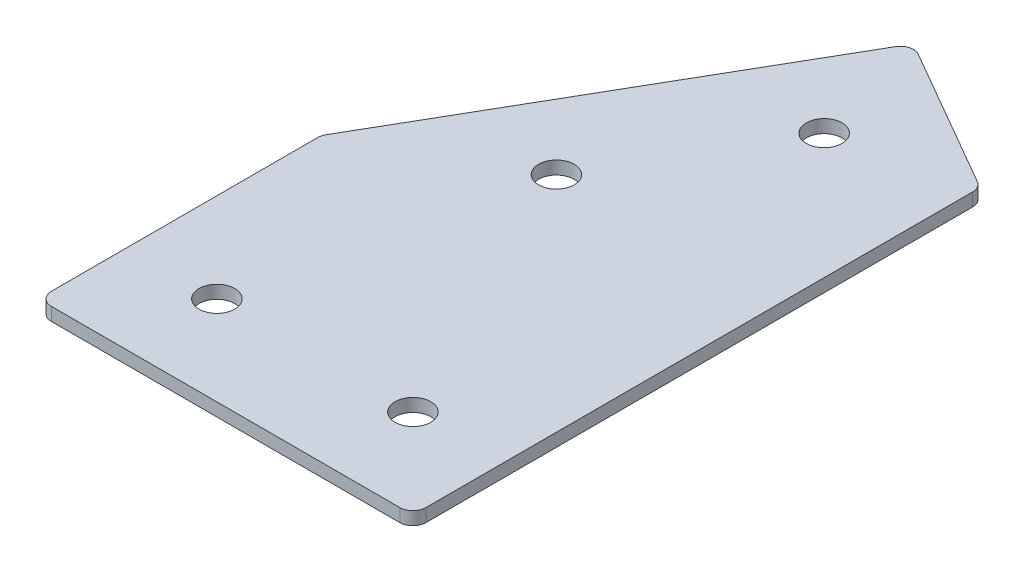
ISO-10303-21;
HEADER;
FILE_DESCRIPTION(('STEP AP214'),'2;1');
FILE_NAME('part.step','',(''),(''),'','','');
FILE_SCHEMA(('AUTOMOTIVE_DESIGN { 1 0 10303 214 1 1 1 1 }'));
ENDSEC;
DATA;
#1=APPLICATION_CONTEXT('core data for automotive mechanical design processes');
#2=APPLICATION_PROTOCOL_DEFINITION('international standard','automotive_design',2000,#1);
#3=PRODUCT_CONTEXT('',#1,'mechanical');
#4=PRODUCT('Part','Part','',(#3));
#5=PRODUCT_RELATED_PRODUCT_CATEGORY('part','',(#4));
#6=PRODUCT_DEFINITION_FORMATION('','',#4);
#7=PRODUCT_DEFINITION_CONTEXT('part definition',#1,'design');
#8=PRODUCT_DEFINITION('design','',#6,#7);
#9=PRODUCT_DEFINITION_SHAPE('','',#8);
#10=(LENGTH_UNIT() NAMED_UNIT(*) SI_UNIT(.MILLI.,.METRE.));
#11=(NAMED_UNIT(*) PLANE_ANGLE_UNIT() SI_UNIT($,.RADIAN.));
#12=(NAMED_UNIT(*) SI_UNIT($,.STERADIAN.) SOLID_ANGLE_UNIT());
#13=UNCERTAINTY_MEASURE_WITH_UNIT(LENGTH_MEASURE(1.E-05),#10,'distance_accuracy_value','');
#14=(GEOMETRIC_REPRESENTATION_CONTEXT(3) GLOBAL_UNCERTAINTY_ASSIGNED_CONTEXT((#13)) GLOBAL_UNIT_ASSIGNED_CONTEXT((#10,
#11,#12)) REPRESENTATION_CONTEXT('',''));
#15=CARTESIAN_POINT('',(0.,0.,0.));
#16=DIRECTION('',(0.,0.,1.));
#17=DIRECTION('',(1.,0.,0.));
#18=AXIS2_PLACEMENT_3D('',#15,#16,#17);
#19=CARTESIAN_POINT('',(0.,0.,0.));
#20=DIRECTION('',(0.,1.,0.));
#21=DIRECTION('',(0.,0.,1.));
#22=AXIS2_PLACEMENT_3D('',#19,#20,#21);
#23=PLANE('',#22);
#24=CARTESIAN_POINT('',(67.5000000000055,0.,0.));
#25=DIRECTION('',(0.,1.,0.));
#26=DIRECTION('',(0.,0.,1.));
#27=AXIS2_PLACEMENT_3D('',#24,#25,#26);
#28=CIRCLE('',#27,4.1);
#29=CARTESIAN_POINT('',(67.5000000000055,0.,4.1));
#30=VERTEX_POINT('',#29);
#31=EDGE_CURVE('E201',#30,#30,#28,.T.);
#32=ORIENTED_EDGE('',*,*,#31,.T.);
#33=EDGE_LOOP('',(#32));
#34=FACE_BOUND('',#33,.T.);
#35=CARTESIAN_POINT('',(59.2644284148556,0.,-102.649001096049));
#36=DIRECTION('',(0.,1.,0.));
#37=DIRECTION('',(0.,0.,1.));
#38=AXIS2_PLACEMENT_3D('',#35,#36,#37);
#39=CIRCLE('',#38,4.09999999999999);
#40=CARTESIAN_POINT('',(59.2644284148556,0.,-98.5490010960489));
#41=VERTEX_POINT('',#40);
#42=EDGE_CURVE('E195',#41,#41,#39,.T.);
#43=ORIENTED_EDGE('',*,*,#42,.T.);
#44=EDGE_LOOP('',(#43));
#45=FACE_BOUND('',#44,.T.);
#46=CARTESIAN_POINT('',(36.7644284148556,0.,-63.6778579257492));
#47=DIRECTION('',(0.,1.,0.));
#48=DIRECTION('',(0.,0.,1.));
#49=AXIS2_PLACEMENT_3D('',#46,#47,#48);
#50=CIRCLE('',#49,4.1);
#51=CARTESIAN_POINT('',(36.7644284148556,0.,-59.5778579257492));
#52=VERTEX_POINT('',#51);
#53=EDGE_CURVE('E189',#52,#52,#50,.T.);
#54=ORIENTED_EDGE('',*,*,#53,.T.);
#55=EDGE_LOOP('',(#54));
#56=FACE_BOUND('',#55,.T.);
#57=CARTESIAN_POINT('',(22.5000000000055,0.,0.));
#58=DIRECTION('',(0.,1.,0.));
#59=DIRECTION('',(0.,0.,1.));
#60=AXIS2_PLACEMENT_3D('',#57,#58,#59);
#61=CIRCLE('',#60,4.1);
#62=CARTESIAN_POINT('',(22.5000000000055,0.,4.1));
#63=VERTEX_POINT('',#62);
#64=EDGE_CURVE('E115',#63,#63,#61,.T.);
#65=ORIENTED_EDGE('',*,*,#64,.T.);
#66=EDGE_LOOP('',(#65));
#67=FACE_BOUND('',#66,.T.);
#68=DIRECTION('',(0.,0.,1.));
#69=VECTOR('',#68,1.);
#70=CARTESIAN_POINT('',(2.00000000000554,0.,-44.464101615138));
#71=LINE('',#70,#69);
#72=CARTESIAN_POINT('',(2.00000000000554,0.,-43.6602540378446));
#73=VERTEX_POINT('',#72);
#74=CARTESIAN_POINT('',(2.00000000000555,0.,17.5000000000001));
#75=VERTEX_POINT('',#74);
#76=EDGE_CURVE('E182',#73,#75,#71,.T.);
#77=ORIENTED_EDGE('',*,*,#76,.F.);
#78=CARTESIAN_POINT('',(5.00000000000555,0.,-43.6602540378446));
#79=DIRECTION('',(0.,1.,0.));
#80=DIRECTION('',(0.,0.,1.));
#81=AXIS2_PLACEMENT_3D('',#78,#79,#80);
#82=CIRCLE('',#81,3.);
#83=CARTESIAN_POINT('',(2.40192378865224,0.,-45.1602540378446));
#84=VERTEX_POINT('',#83);
#85=EDGE_CURVE('E146',#73,#84,#82,.F.);
#86=ORIENTED_EDGE('',*,*,#85,.T.);
#87=DIRECTION('',(-0.5,0.,0.866025403784438));
#88=VECTOR('',#87,1.);
#89=CARTESIAN_POINT('',(51.7609076372745,0.,-130.65252187363));
#90=LINE('',#89,#88);
#91=CARTESIAN_POINT('',(50.2609076372745,0.,-128.054445662277));
#92=VERTEX_POINT('',#91);
#93=EDGE_CURVE('E174',#92,#84,#90,.T.);
#94=ORIENTED_EDGE('',*,*,#93,.F.);
#95=CARTESIAN_POINT('',(52.8589838486278,0.,-126.554445662277));
#96=DIRECTION('',(0.,1.,0.));
#97=DIRECTION('',(0.,0.,1.));
#98=AXIS2_PLACEMENT_3D('',#95,#96,#97);
#99=CIRCLE('',#98,3.);
#100=CARTESIAN_POINT('',(54.3589838486279,0.,-129.15252187363));
#101=VERTEX_POINT('',#100);
#102=EDGE_CURVE('E118',#92,#101,#99,.F.);
#103=ORIENTED_EDGE('',*,*,#102,.T.);
#104=DIRECTION('',(-0.866025403784438,0.,-0.5));
#105=VECTOR('',#104,1.);
#106=CARTESIAN_POINT('',(88.0000000000055,0.,-109.729872142819));
#107=LINE('',#106,#105);
#108=CARTESIAN_POINT('',(86.5000000000055,0.,-110.595897546604));
#109=VERTEX_POINT('',#108);
#110=EDGE_CURVE('E119',#109,#101,#107,.T.);
#111=ORIENTED_EDGE('',*,*,#110,.F.);
#112=CARTESIAN_POINT('',(85.0000000000055,0.,-107.997821335251));
#113=DIRECTION('',(0.,1.,0.));
#114=DIRECTION('',(0.,0.,1.));
#115=AXIS2_PLACEMENT_3D('',#112,#113,#114);
#116=CIRCLE('',#115,3.);
#117=CARTESIAN_POINT('',(88.0000000000055,0.,-107.997821335251));
#118=VERTEX_POINT('',#117);
#119=EDGE_CURVE('E141',#109,#118,#116,.F.);
#120=ORIENTED_EDGE('',*,*,#119,.T.);
#121=DIRECTION('',(0.,0.,-1.));
#122=VECTOR('',#121,1.);
#123=CARTESIAN_POINT('',(88.0000000000055,0.,20.5000000000001));
#124=LINE('',#123,#122);
#125=CARTESIAN_POINT('',(88.0000000000055,0.,17.5000000000001));
#126=VERTEX_POINT('',#125);
#127=EDGE_CURVE('E123',#126,#118,#124,.T.);
#128=ORIENTED_EDGE('',*,*,#127,.F.);
#129=CARTESIAN_POINT('',(85.0000000000055,0.,17.5000000000001));
#130=DIRECTION('',(0.,1.,0.));
#131=DIRECTION('',(0.,0.,1.));
#132=AXIS2_PLACEMENT_3D('',#129,#130,#131);
#133=CIRCLE('',#132,3.);
#134=CARTESIAN_POINT('',(85.0000000000055,0.,20.5000000000001));
#135=VERTEX_POINT('',#134);
#136=EDGE_CURVE('E31',#126,#135,#133,.F.);
#137=ORIENTED_EDGE('',*,*,#136,.T.);
#138=DIRECTION('',(1.,0.,0.));
#139=VECTOR('',#138,1.);
#140=CARTESIAN_POINT('',(2.00000000000555,0.,20.5000000000001));
#141=LINE('',#140,#139);
#142=CARTESIAN_POINT('',(5.00000000000555,0.,20.5000000000001));
#143=VERTEX_POINT('',#142);
#144=EDGE_CURVE('E180',#143,#135,#141,.T.);
#145=ORIENTED_EDGE('',*,*,#144,.F.);
#146=CARTESIAN_POINT('',(5.00000000000555,0.,17.5000000000001));
#147=DIRECTION('',(0.,1.,0.));
#148=DIRECTION('',(0.,0.,1.));
#149=AXIS2_PLACEMENT_3D('',#146,#147,#148);
#150=CIRCLE('',#149,3.);
#151=EDGE_CURVE('E144',#143,#75,#150,.F.);
#152=ORIENTED_EDGE('',*,*,#151,.T.);
#153=EDGE_LOOP('',(#77,#86,#94,#103,#111,#120,#128,#137,#145,#152));
#154=FACE_BOUND('',#153,.T.);
#155=ADVANCED_FACE('F16',(#34,#45,#56,#67,#154),#23,.F.);
#156=CARTESIAN_POINT('',(51.7609076372745,0.,-130.65252187363));
#157=DIRECTION('',(-0.866025403784439,0.,-0.5));
#158=DIRECTION('',(-0.5,0.,0.866025403784439));
#159=AXIS2_PLACEMENT_3D('',#156,#157,#158);
#160=PLANE('',#159);
#161=ORIENTED_EDGE('',*,*,#93,.T.);
#162=DIRECTION('',(0.,1.,0.));
#163=VECTOR('',#162,1.);
#164=CARTESIAN_POINT('',(2.40192378865223,0.,-45.1602540378446));
#165=LINE('',#164,#163);
#166=CARTESIAN_POINT('',(2.40192378865224,3.,-45.1602540378446));
#167=VERTEX_POINT('',#166);
#168=EDGE_CURVE('E105',#84,#167,#165,.T.);
#169=ORIENTED_EDGE('',*,*,#168,.T.);
#170=DIRECTION('',(-0.5,0.,0.866025403784438));
#171=VECTOR('',#170,1.);
#172=CARTESIAN_POINT('',(51.7609076372745,3.,-130.65252187363));
#173=LINE('',#172,#171);
#174=CARTESIAN_POINT('',(50.2609076372745,3.,-128.054445662277));
#175=VERTEX_POINT('',#174);
#176=EDGE_CURVE('E97',#175,#167,#173,.T.);
#177=ORIENTED_EDGE('',*,*,#176,.F.);
#178=DIRECTION('',(0.,1.,0.));
#179=VECTOR('',#178,1.);
#180=CARTESIAN_POINT('',(50.2609076372745,0.,-128.054445662277));
#181=LINE('',#180,#179);
#182=EDGE_CURVE('E111',#175,#92,#181,.F.);
#183=ORIENTED_EDGE('',*,*,#182,.T.);
#184=EDGE_LOOP('',(#161,#169,#177,#183));
#185=FACE_BOUND('',#184,.T.);
#186=ADVANCED_FACE('F110',(#185),#160,.T.);
#187=CARTESIAN_POINT('',(88.0000000000055,0.,-109.729872142819));
#188=DIRECTION('',(0.5,0.,-0.866025403784438));
#189=DIRECTION('',(-0.866025403784438,0.,-0.5));
#190=AXIS2_PLACEMENT_3D('',#187,#188,#189);
#191=PLANE('',#190);
#192=DIRECTION('',(-0.866025403784438,0.,-0.5));
#193=VECTOR('',#192,1.);
#194=CARTESIAN_POINT('',(88.0000000000055,3.,-109.729872142819));
#195=LINE('',#194,#193);
#196=CARTESIAN_POINT('',(86.5000000000055,3.,-110.595897546604));
#197=VERTEX_POINT('',#196);
#198=CARTESIAN_POINT('',(54.3589838486279,3.,-129.15252187363));
#199=VERTEX_POINT('',#198);
#200=EDGE_CURVE('E99',#197,#199,#195,.T.);
#201=ORIENTED_EDGE('',*,*,#200,.F.);
#202=DIRECTION('',(0.,1.,0.));
#203=VECTOR('',#202,1.);
#204=CARTESIAN_POINT('',(86.5000000000055,0.,-110.595897546604));
#205=LINE('',#204,#203);
#206=EDGE_CURVE('E10',#197,#109,#205,.F.);
#207=ORIENTED_EDGE('',*,*,#206,.T.);
#208=ORIENTED_EDGE('',*,*,#110,.T.);
#209=DIRECTION('',(0.,1.,0.));
#210=VECTOR('',#209,1.);
#211=CARTESIAN_POINT('',(54.3589838486278,0.,-129.15252187363));
#212=LINE('',#211,#210);
#213=EDGE_CURVE('E24',#101,#199,#212,.T.);
#214=ORIENTED_EDGE('',*,*,#213,.T.);
#215=EDGE_LOOP('',(#201,#207,#208,#214));
#216=FACE_BOUND('',#215,.T.);
#217=ADVANCED_FACE('F157',(#216),#191,.T.);
#218=CARTESIAN_POINT('',(88.0000000000055,0.,20.5000000000001));
#219=DIRECTION('',(1.,0.,0.));
#220=DIRECTION('',(0.,0.,-1.));
#221=AXIS2_PLACEMENT_3D('',#218,#219,#220);
#222=PLANE('',#221);
#223=DIRECTION('',(0.,0.,-1.));
#224=VECTOR('',#223,1.);
#225=CARTESIAN_POINT('',(88.0000000000055,3.,20.5000000000001));
#226=LINE('',#225,#224);
#227=CARTESIAN_POINT('',(88.0000000000055,3.,17.5000000000001));
#228=VERTEX_POINT('',#227);
#229=CARTESIAN_POINT('',(88.0000000000055,3.,-107.997821335251));
#230=VERTEX_POINT('',#229);
#231=EDGE_CURVE('E170',#228,#230,#226,.T.);
#232=ORIENTED_EDGE('',*,*,#231,.F.);
#233=DIRECTION('',(0.,1.,0.));
#234=VECTOR('',#233,1.);
#235=CARTESIAN_POINT('',(88.0000000000055,0.,17.5000000000001));
#236=LINE('',#235,#234);
#237=EDGE_CURVE('E155',#228,#126,#236,.F.);
#238=ORIENTED_EDGE('',*,*,#237,.T.);
#239=ORIENTED_EDGE('',*,*,#127,.T.);
#240=DIRECTION('',(0.,1.,0.));
#241=VECTOR('',#240,1.);
#242=CARTESIAN_POINT('',(88.0000000000055,0.,-107.997821335251));
#243=LINE('',#242,#241);
#244=EDGE_CURVE('E152',#118,#230,#243,.T.);
#245=ORIENTED_EDGE('',*,*,#244,.T.);
#246=EDGE_LOOP('',(#232,#238,#239,#245));
#247=FACE_BOUND('',#246,.T.);
#248=ADVANCED_FACE('F169',(#247),#222,.T.);
#249=CARTESIAN_POINT('',(2.00000000000555,0.,20.5000000000001));
#250=DIRECTION('',(0.,0.,1.));
#251=DIRECTION('',(1.,0.,0.));
#252=AXIS2_PLACEMENT_3D('',#249,#250,#251);
#253=PLANE('',#252);
#254=DIRECTION('',(1.,0.,0.));
#255=VECTOR('',#254,1.);
#256=CARTESIAN_POINT('',(2.00000000000555,3.,20.5000000000001));
#257=LINE('',#256,#255);
#258=CARTESIAN_POINT('',(5.00000000000555,3.,20.5000000000001));
#259=VERTEX_POINT('',#258);
#260=CARTESIAN_POINT('',(85.0000000000055,3.,20.5000000000001));
#261=VERTEX_POINT('',#260);
#262=EDGE_CURVE('E173',#259,#261,#257,.T.);
#263=ORIENTED_EDGE('',*,*,#262,.F.);
#264=DIRECTION('',(0.,1.,0.));
#265=VECTOR('',#264,1.);
#266=CARTESIAN_POINT('',(5.00000000000555,0.,20.5000000000001));
#267=LINE('',#266,#265);
#268=EDGE_CURVE('E38',#259,#143,#267,.F.);
#269=ORIENTED_EDGE('',*,*,#268,.T.);
#270=ORIENTED_EDGE('',*,*,#144,.T.);
#271=DIRECTION('',(0.,1.,0.));
#272=VECTOR('',#271,1.);
#273=CARTESIAN_POINT('',(85.0000000000055,0.,20.5000000000001));
#274=LINE('',#273,#272);
#275=EDGE_CURVE('E148',#135,#261,#274,.T.);
#276=ORIENTED_EDGE('',*,*,#275,.T.);
#277=EDGE_LOOP('',(#263,#269,#270,#276));
#278=FACE_BOUND('',#277,.T.);
#279=ADVANCED_FACE('F337',(#278),#253,.T.);
#280=CARTESIAN_POINT('',(2.00000000000554,0.,-44.464101615138));
#281=DIRECTION('',(-1.,0.,0.));
#282=DIRECTION('',(0.,0.,1.));
#283=AXIS2_PLACEMENT_3D('',#280,#281,#282);
#284=PLANE('',#283);
#285=DIRECTION('',(0.,0.,1.));
#286=VECTOR('',#285,1.);
#287=CARTESIAN_POINT('',(2.00000000000554,3.,-44.464101615138));
#288=LINE('',#287,#286);
#289=CARTESIAN_POINT('',(2.00000000000554,3.,-43.6602540378446));
#290=VERTEX_POINT('',#289);
#291=CARTESIAN_POINT('',(2.00000000000555,3.,17.5000000000001));
#292=VERTEX_POINT('',#291);
#293=EDGE_CURVE('E114',#290,#292,#288,.T.);
#294=ORIENTED_EDGE('',*,*,#293,.F.);
#295=DIRECTION('',(0.,1.,0.));
#296=VECTOR('',#295,1.);
#297=CARTESIAN_POINT('',(2.00000000000554,0.,-43.6602540378446));
#298=LINE('',#297,#296);
#299=EDGE_CURVE('E138',#290,#73,#298,.F.);
#300=ORIENTED_EDGE('',*,*,#299,.T.);
#301=ORIENTED_EDGE('',*,*,#76,.T.);
#302=DIRECTION('',(0.,1.,0.));
#303=VECTOR('',#302,1.);
#304=CARTESIAN_POINT('',(2.00000000000555,0.,17.5000000000001));
#305=LINE('',#304,#303);
#306=EDGE_CURVE('E135',#75,#292,#305,.T.);
#307=ORIENTED_EDGE('',*,*,#306,.T.);
#308=EDGE_LOOP('',(#294,#300,#301,#307));
#309=FACE_BOUND('',#308,.T.);
#310=ADVANCED_FACE('F223',(#309),#284,.T.);
#311=CARTESIAN_POINT('',(0.,3.,0.));
#312=DIRECTION('',(0.,1.,0.));
#313=DIRECTION('',(0.,0.,1.));
#314=AXIS2_PLACEMENT_3D('',#311,#312,#313);
#315=PLANE('',#314);
#316=CARTESIAN_POINT('',(67.5000000000055,3.,0.));
#317=DIRECTION('',(0.,1.,0.));
#318=DIRECTION('',(0.,0.,1.));
#319=AXIS2_PLACEMENT_3D('',#316,#317,#318);
#320=CIRCLE('',#319,4.1);
#321=CARTESIAN_POINT('',(67.5000000000055,3.,4.1));
#322=VERTEX_POINT('',#321);
#323=EDGE_CURVE('E204',#322,#322,#320,.T.);
#324=ORIENTED_EDGE('',*,*,#323,.F.);
#325=EDGE_LOOP('',(#324));
#326=FACE_BOUND('',#325,.T.);
#327=CARTESIAN_POINT('',(59.2644284148556,3.,-102.649001096049));
#328=DIRECTION('',(0.,1.,0.));
#329=DIRECTION('',(0.,0.,1.));
#330=AXIS2_PLACEMENT_3D('',#327,#328,#329);
#331=CIRCLE('',#330,4.09999999999999);
#332=CARTESIAN_POINT('',(59.2644284148556,3.,-98.5490010960489));
#333=VERTEX_POINT('',#332);
#334=EDGE_CURVE('E198',#333,#333,#331,.T.);
#335=ORIENTED_EDGE('',*,*,#334,.F.);
#336=EDGE_LOOP('',(#335));
#337=FACE_BOUND('',#336,.T.);
#338=CARTESIAN_POINT('',(36.7644284148556,3.,-63.6778579257492));
#339=DIRECTION('',(0.,1.,0.));
#340=DIRECTION('',(0.,0.,1.));
#341=AXIS2_PLACEMENT_3D('',#338,#339,#340);
#342=CIRCLE('',#341,4.1);
#343=CARTESIAN_POINT('',(36.7644284148556,3.,-59.5778579257492));
#344=VERTEX_POINT('',#343);
#345=EDGE_CURVE('E192',#344,#344,#342,.T.);
#346=ORIENTED_EDGE('',*,*,#345,.F.);
#347=EDGE_LOOP('',(#346));
#348=FACE_BOUND('',#347,.T.);
#349=CARTESIAN_POINT('',(22.5000000000055,3.,0.));
#350=DIRECTION('',(0.,1.,0.));
#351=DIRECTION('',(0.,0.,1.));
#352=AXIS2_PLACEMENT_3D('',#349,#350,#351);
#353=CIRCLE('',#352,4.1);
#354=CARTESIAN_POINT('',(22.5000000000055,3.,4.1));
#355=VERTEX_POINT('',#354);
#356=EDGE_CURVE('E186',#355,#355,#353,.T.);
#357=ORIENTED_EDGE('',*,*,#356,.F.);
#358=EDGE_LOOP('',(#357));
#359=FACE_BOUND('',#358,.T.);
#360=ORIENTED_EDGE('',*,*,#176,.T.);
#361=CARTESIAN_POINT('',(5.00000000000555,3.,-43.6602540378446));
#362=DIRECTION('',(0.,1.,0.));
#363=DIRECTION('',(0.,0.,1.));
#364=AXIS2_PLACEMENT_3D('',#361,#362,#363);
#365=CIRCLE('',#364,3.);
#366=EDGE_CURVE('E133',#167,#290,#365,.T.);
#367=ORIENTED_EDGE('',*,*,#366,.T.);
#368=ORIENTED_EDGE('',*,*,#293,.T.);
#369=CARTESIAN_POINT('',(5.00000000000555,3.,17.5000000000001));
#370=DIRECTION('',(0.,1.,0.));
#371=DIRECTION('',(0.,0.,1.));
#372=AXIS2_PLACEMENT_3D('',#369,#370,#371);
#373=CIRCLE('',#372,3.);
#374=EDGE_CURVE('E131',#292,#259,#373,.T.);
#375=ORIENTED_EDGE('',*,*,#374,.T.);
#376=ORIENTED_EDGE('',*,*,#262,.T.);
#377=CARTESIAN_POINT('',(85.0000000000055,3.,17.5000000000001));
#378=DIRECTION('',(0.,1.,0.));
#379=DIRECTION('',(0.,0.,1.));
#380=AXIS2_PLACEMENT_3D('',#377,#378,#379);
#381=CIRCLE('',#380,3.);
#382=EDGE_CURVE('E129',#261,#228,#381,.T.);
#383=ORIENTED_EDGE('',*,*,#382,.T.);
#384=ORIENTED_EDGE('',*,*,#231,.T.);
#385=CARTESIAN_POINT('',(85.0000000000055,3.,-107.997821335251));
#386=DIRECTION('',(0.,1.,0.));
#387=DIRECTION('',(0.,0.,1.));
#388=AXIS2_PLACEMENT_3D('',#385,#386,#387);
#389=CIRCLE('',#388,3.);
#390=EDGE_CURVE('E104',#230,#197,#389,.T.);
#391=ORIENTED_EDGE('',*,*,#390,.T.);
#392=ORIENTED_EDGE('',*,*,#200,.T.);
#393=CARTESIAN_POINT('',(52.8589838486278,3.,-126.554445662277));
#394=DIRECTION('',(0.,1.,0.));
#395=DIRECTION('',(0.,0.,1.));
#396=AXIS2_PLACEMENT_3D('',#393,#394,#395);
#397=CIRCLE('',#396,3.);
#398=EDGE_CURVE('E94',#199,#175,#397,.T.);
#399=ORIENTED_EDGE('',*,*,#398,.T.);
#400=EDGE_LOOP('',(#360,#367,#368,#375,#376,#383,#384,#391,#392,#399));
#401=FACE_BOUND('',#400,.T.);
#402=ADVANCED_FACE('F96',(#326,#337,#348,#359,#401),#315,.T.);
#403=CARTESIAN_POINT('',(22.5000000000055,0.,0.));
#404=DIRECTION('',(0.,1.,0.));
#405=DIRECTION('',(0.,0.,1.));
#406=AXIS2_PLACEMENT_3D('',#403,#404,#405);
#407=CYLINDRICAL_SURFACE('',#406,4.1);
#408=ORIENTED_EDGE('',*,*,#64,.F.);
#409=EDGE_LOOP('',(#408));
#410=FACE_BOUND('',#409,.T.);
#411=ORIENTED_EDGE('',*,*,#356,.T.);
#412=EDGE_LOOP('',(#411));
#413=FACE_BOUND('',#412,.T.);
#414=ADVANCED_FACE('F222',(#410,#413),#407,.F.);
#415=CARTESIAN_POINT('',(36.7644284148556,0.,-63.6778579257492));
#416=DIRECTION('',(0.,1.,0.));
#417=DIRECTION('',(0.,0.,1.));
#418=AXIS2_PLACEMENT_3D('',#415,#416,#417);
#419=CYLINDRICAL_SURFACE('',#418,4.1);
#420=ORIENTED_EDGE('',*,*,#53,.F.);
#421=EDGE_LOOP('',(#420));
#422=FACE_BOUND('',#421,.T.);
#423=ORIENTED_EDGE('',*,*,#345,.T.);
#424=EDGE_LOOP('',(#423));
#425=FACE_BOUND('',#424,.T.);
#426=ADVANCED_FACE('F232',(#422,#425),#419,.F.);
#427=CARTESIAN_POINT('',(59.2644284148556,0.,-102.649001096049));
#428=DIRECTION('',(0.,1.,0.));
#429=DIRECTION('',(0.,0.,1.));
#430=AXIS2_PLACEMENT_3D('',#427,#428,#429);
#431=CYLINDRICAL_SURFACE('',#430,4.09999999999999);
#432=ORIENTED_EDGE('',*,*,#42,.F.);
#433=EDGE_LOOP('',(#432));
#434=FACE_BOUND('',#433,.T.);
#435=ORIENTED_EDGE('',*,*,#334,.T.);
#436=EDGE_LOOP('',(#435));
#437=FACE_BOUND('',#436,.T.);
#438=ADVANCED_FACE('F216',(#434,#437),#431,.F.);
#439=CARTESIAN_POINT('',(67.5000000000055,0.,0.));
#440=DIRECTION('',(0.,1.,0.));
#441=DIRECTION('',(0.,0.,1.));
#442=AXIS2_PLACEMENT_3D('',#439,#440,#441);
#443=CYLINDRICAL_SURFACE('',#442,4.1);
#444=ORIENTED_EDGE('',*,*,#31,.F.);
#445=EDGE_LOOP('',(#444));
#446=FACE_BOUND('',#445,.T.);
#447=ORIENTED_EDGE('',*,*,#323,.T.);
#448=EDGE_LOOP('',(#447));
#449=FACE_BOUND('',#448,.T.);
#450=ADVANCED_FACE('F212',(#446,#449),#443,.F.);
#451=CARTESIAN_POINT('',(5.00000000000555,0.,-43.6602540378446));
#452=DIRECTION('',(0.,1.,0.));
#453=DIRECTION('',(0.,0.,1.));
#454=AXIS2_PLACEMENT_3D('',#451,#452,#453);
#455=CYLINDRICAL_SURFACE('',#454,3.);
#456=ORIENTED_EDGE('',*,*,#85,.F.);
#457=ORIENTED_EDGE('',*,*,#299,.F.);
#458=ORIENTED_EDGE('',*,*,#366,.F.);
#459=ORIENTED_EDGE('',*,*,#168,.F.);
#460=EDGE_LOOP('',(#456,#457,#458,#459));
#461=FACE_BOUND('',#460,.T.);
#462=ADVANCED_FACE('F215',(#461),#455,.T.);
#463=CARTESIAN_POINT('',(5.00000000000555,0.,17.5000000000001));
#464=DIRECTION('',(0.,1.,0.));
#465=DIRECTION('',(0.,0.,1.));
#466=AXIS2_PLACEMENT_3D('',#463,#464,#465);
#467=CYLINDRICAL_SURFACE('',#466,3.);
#468=ORIENTED_EDGE('',*,*,#151,.F.);
#469=ORIENTED_EDGE('',*,*,#268,.F.);
#470=ORIENTED_EDGE('',*,*,#374,.F.);
#471=ORIENTED_EDGE('',*,*,#306,.F.);
#472=EDGE_LOOP('',(#468,#469,#470,#471));
#473=FACE_BOUND('',#472,.T.);
#474=ADVANCED_FACE('F252',(#473),#467,.T.);
#475=CARTESIAN_POINT('',(85.0000000000055,0.,17.5000000000001));
#476=DIRECTION('',(0.,1.,0.));
#477=DIRECTION('',(0.,0.,1.));
#478=AXIS2_PLACEMENT_3D('',#475,#476,#477);
#479=CYLINDRICAL_SURFACE('',#478,3.);
#480=ORIENTED_EDGE('',*,*,#136,.F.);
#481=ORIENTED_EDGE('',*,*,#237,.F.);
#482=ORIENTED_EDGE('',*,*,#382,.F.);
#483=ORIENTED_EDGE('',*,*,#275,.F.);
#484=EDGE_LOOP('',(#480,#481,#482,#483));
#485=FACE_BOUND('',#484,.T.);
#486=ADVANCED_FACE('F256',(#485),#479,.T.);
#487=CARTESIAN_POINT('',(85.0000000000055,0.,-107.997821335251));
#488=DIRECTION('',(0.,1.,0.));
#489=DIRECTION('',(0.,0.,1.));
#490=AXIS2_PLACEMENT_3D('',#487,#488,#489);
#491=CYLINDRICAL_SURFACE('',#490,3.);
#492=ORIENTED_EDGE('',*,*,#119,.F.);
#493=ORIENTED_EDGE('',*,*,#206,.F.);
#494=ORIENTED_EDGE('',*,*,#390,.F.);
#495=ORIENTED_EDGE('',*,*,#244,.F.);
#496=EDGE_LOOP('',(#492,#493,#494,#495));
#497=FACE_BOUND('',#496,.T.);
#498=ADVANCED_FACE('F165',(#497),#491,.T.);
#499=CARTESIAN_POINT('',(52.8589838486278,0.,-126.554445662277));
#500=DIRECTION('',(0.,1.,0.));
#501=DIRECTION('',(0.,0.,1.));
#502=AXIS2_PLACEMENT_3D('',#499,#500,#501);
#503=CYLINDRICAL_SURFACE('',#502,3.);
#504=ORIENTED_EDGE('',*,*,#102,.F.);
#505=ORIENTED_EDGE('',*,*,#182,.F.);
#506=ORIENTED_EDGE('',*,*,#398,.F.);
#507=ORIENTED_EDGE('',*,*,#213,.F.);
#508=EDGE_LOOP('',(#504,#505,#506,#507));
#509=FACE_BOUND('',#508,.T.);
#510=ADVANCED_FACE('F18',(#509),#503,.T.);
#511=CLOSED_SHELL('',(#155,#186,#217,#248,#279,#310,#402,#414,#426,#438,#450,#462,#474,#486,
#498,#510));
#512=MANIFOLD_SOLID_BREP('B1',#511);
#513=ADVANCED_BREP_SHAPE_REPRESENTATION('',(#18,#512),#14);
#514=SHAPE_DEFINITION_REPRESENTATION(#9,#513);
ENDSEC;
END-ISO-10303-21;
